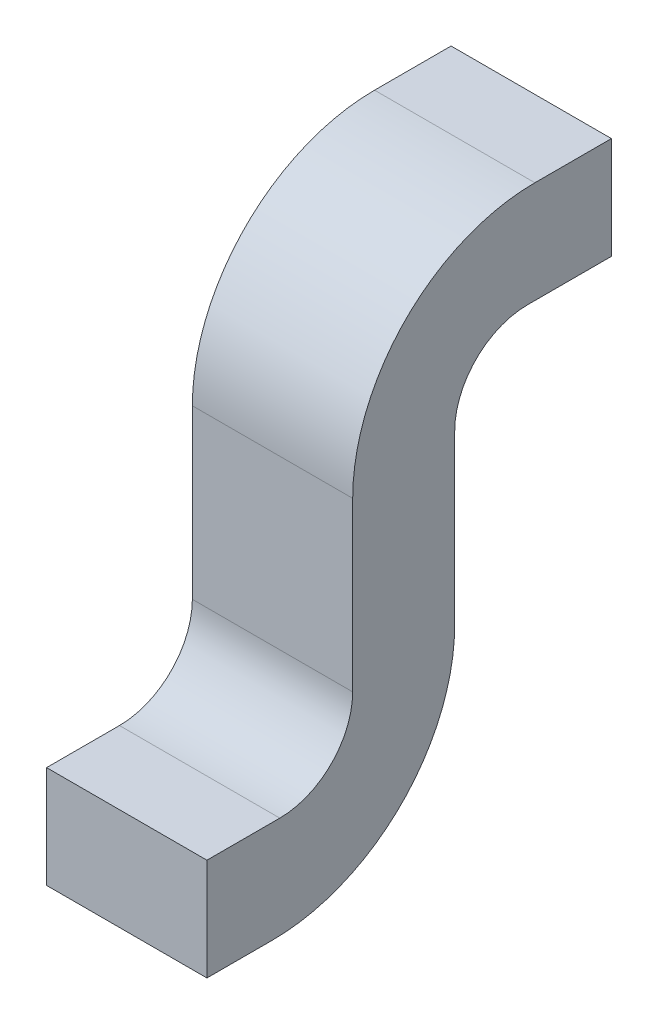
ISO-10303-21;
HEADER;
FILE_DESCRIPTION(('STEP AP214'),'2;1');
FILE_NAME('part.step','',(''),(''),'','','');
FILE_SCHEMA(('AUTOMOTIVE_DESIGN { 1 0 10303 214 1 1 1 1 }'));
ENDSEC;
DATA;
#1=APPLICATION_CONTEXT('core data for automotive mechanical design processes');
#2=APPLICATION_PROTOCOL_DEFINITION('international standard','automotive_design',2000,#1);
#3=PRODUCT_CONTEXT('',#1,'mechanical');
#4=PRODUCT('Part','Part','',(#3));
#5=PRODUCT_RELATED_PRODUCT_CATEGORY('part','',(#4));
#6=PRODUCT_DEFINITION_FORMATION('','',#4);
#7=PRODUCT_DEFINITION_CONTEXT('part definition',#1,'design');
#8=PRODUCT_DEFINITION('design','',#6,#7);
#9=PRODUCT_DEFINITION_SHAPE('','',#8);
#10=(LENGTH_UNIT() NAMED_UNIT(*) SI_UNIT(.MILLI.,.METRE.));
#11=(NAMED_UNIT(*) PLANE_ANGLE_UNIT() SI_UNIT($,.RADIAN.));
#12=(NAMED_UNIT(*) SI_UNIT($,.STERADIAN.) SOLID_ANGLE_UNIT());
#13=UNCERTAINTY_MEASURE_WITH_UNIT(LENGTH_MEASURE(1.E-05),#10,'distance_accuracy_value','');
#14=(GEOMETRIC_REPRESENTATION_CONTEXT(3) GLOBAL_UNCERTAINTY_ASSIGNED_CONTEXT((#13)) GLOBAL_UNIT_ASSIGNED_CONTEXT((#10,
#11,#12)) REPRESENTATION_CONTEXT('',''));
#15=CARTESIAN_POINT('',(0.,0.,0.));
#16=DIRECTION('',(0.,0.,1.));
#17=DIRECTION('',(1.,0.,0.));
#18=AXIS2_PLACEMENT_3D('',#15,#16,#17);
#19=CARTESIAN_POINT('',(0.76,0.165,0.545));
#20=DIRECTION('',(-1.,0.,0.));
#21=DIRECTION('',(0.,1.,0.));
#22=AXIS2_PLACEMENT_3D('',#19,#20,#21);
#23=PLANE('',#22);
#24=DIRECTION('',(0.,1.,0.));
#25=VECTOR('',#24,1.);
#26=CARTESIAN_POINT('',(0.76,0.165,1.1));
#27=LINE('',#26,#25);
#28=CARTESIAN_POINT('',(0.76,-0.485,1.1));
#29=VERTEX_POINT('',#28);
#30=CARTESIAN_POINT('',(0.76,-0.345,1.1));
#31=VERTEX_POINT('',#30);
#32=EDGE_CURVE('E198',#29,#31,#27,.T.);
#33=ORIENTED_EDGE('',*,*,#32,.F.);
#34=DIRECTION('',(0.,0.,1.));
#35=VECTOR('',#34,1.);
#36=CARTESIAN_POINT('',(0.76,-0.485,0.545));
#37=LINE('',#36,#35);
#38=CARTESIAN_POINT('',(0.76,-0.485,1.01));
#39=VERTEX_POINT('',#38);
#40=EDGE_CURVE('E199',#39,#29,#37,.T.);
#41=ORIENTED_EDGE('',*,*,#40,.F.);
#42=CARTESIAN_POINT('',(0.76,-0.235,1.01));
#43=DIRECTION('',(-1.,0.,0.));
#44=DIRECTION('',(0.,0.,1.));
#45=AXIS2_PLACEMENT_3D('',#42,#43,#44);
#46=CIRCLE('',#45,0.25);
#47=CARTESIAN_POINT('',(0.76,-0.235,0.76));
#48=VERTEX_POINT('',#47);
#49=EDGE_CURVE('E267',#48,#39,#46,.T.);
#50=ORIENTED_EDGE('',*,*,#49,.F.);
#51=DIRECTION('',(0.,-1.,0.));
#52=VECTOR('',#51,1.);
#53=CARTESIAN_POINT('',(0.76,0.165,0.76));
#54=LINE('',#53,#52);
#55=CARTESIAN_POINT('',(0.76,-0.004999999999999,0.76));
#56=VERTEX_POINT('',#55);
#57=EDGE_CURVE('E138',#56,#48,#54,.T.);
#58=ORIENTED_EDGE('',*,*,#57,.F.);
#59=CARTESIAN_POINT('',(0.76,-0.004999999999999,0.66));
#60=DIRECTION('',(1.,0.,0.));
#61=DIRECTION('',(0.,0.,1.));
#62=AXIS2_PLACEMENT_3D('',#59,#60,#61);
#63=CIRCLE('',#62,0.1);
#64=CARTESIAN_POINT('',(0.76,0.095,0.66));
#65=VERTEX_POINT('',#64);
#66=EDGE_CURVE('E143',#65,#56,#63,.T.);
#67=ORIENTED_EDGE('',*,*,#66,.F.);
#68=DIRECTION('',(0.,0.,1.));
#69=VECTOR('',#68,1.);
#70=CARTESIAN_POINT('',(0.76,0.095,0.545));
#71=LINE('',#70,#69);
#72=CARTESIAN_POINT('',(0.76,0.095,0.545));
#73=VERTEX_POINT('',#72);
#74=EDGE_CURVE('E146',#73,#65,#71,.T.);
#75=ORIENTED_EDGE('',*,*,#74,.F.);
#76=DIRECTION('',(0.,-1.,0.));
#77=VECTOR('',#76,1.);
#78=CARTESIAN_POINT('',(0.76,0.165,0.545));
#79=LINE('',#78,#77);
#80=CARTESIAN_POINT('',(0.76,0.235,0.545));
#81=VERTEX_POINT('',#80);
#82=EDGE_CURVE('E171',#81,#73,#79,.T.);
#83=ORIENTED_EDGE('',*,*,#82,.F.);
#84=DIRECTION('',(0.,0.,-1.));
#85=VECTOR('',#84,1.);
#86=CARTESIAN_POINT('',(0.76,0.235,0.545));
#87=LINE('',#86,#85);
#88=CARTESIAN_POINT('',(0.76,0.235,0.65));
#89=VERTEX_POINT('',#88);
#90=EDGE_CURVE('E200',#89,#81,#87,.T.);
#91=ORIENTED_EDGE('',*,*,#90,.F.);
#92=CARTESIAN_POINT('',(0.76,-0.015,0.65));
#93=DIRECTION('',(-1.,0.,0.));
#94=DIRECTION('',(0.,0.,1.));
#95=AXIS2_PLACEMENT_3D('',#92,#93,#94);
#96=CIRCLE('',#95,0.25);
#97=CARTESIAN_POINT('',(0.76,-0.015,0.9));
#98=VERTEX_POINT('',#97);
#99=EDGE_CURVE('E204',#98,#89,#96,.T.);
#100=ORIENTED_EDGE('',*,*,#99,.F.);
#101=DIRECTION('',(0.,1.,0.));
#102=VECTOR('',#101,1.);
#103=CARTESIAN_POINT('',(0.76,0.165,0.9));
#104=LINE('',#103,#102);
#105=CARTESIAN_POINT('',(0.76,-0.245,0.9));
#106=VERTEX_POINT('',#105);
#107=EDGE_CURVE('E208',#106,#98,#104,.T.);
#108=ORIENTED_EDGE('',*,*,#107,.F.);
#109=CARTESIAN_POINT('',(0.76,-0.245,1.));
#110=DIRECTION('',(1.,0.,0.));
#111=DIRECTION('',(0.,0.,1.));
#112=AXIS2_PLACEMENT_3D('',#109,#110,#111);
#113=CIRCLE('',#112,0.1);
#114=CARTESIAN_POINT('',(0.76,-0.345,1.));
#115=VERTEX_POINT('',#114);
#116=EDGE_CURVE('E209',#115,#106,#113,.T.);
#117=ORIENTED_EDGE('',*,*,#116,.F.);
#118=DIRECTION('',(0.,0.,-1.));
#119=VECTOR('',#118,1.);
#120=CARTESIAN_POINT('',(0.76,-0.345,0.545));
#121=LINE('',#120,#119);
#122=EDGE_CURVE('E11',#31,#115,#121,.T.);
#123=ORIENTED_EDGE('',*,*,#122,.F.);
#124=EDGE_LOOP('',(#33,#41,#50,#58,#67,#75,#83,#91,#100,#108,#117,#123));
#125=FACE_BOUND('',#124,.T.);
#126=ADVANCED_FACE('F16',(#125),#23,.F.);
#127=CARTESIAN_POINT('',(0.54,-0.345,1.05));
#128=DIRECTION('',(0.,1.,0.));
#129=DIRECTION('',(0.,0.,-1.));
#130=AXIS2_PLACEMENT_3D('',#127,#128,#129);
#131=PLANE('',#130);
#132=DIRECTION('',(0.,0.,1.));
#133=VECTOR('',#132,1.);
#134=CARTESIAN_POINT('',(0.54,-0.345,1.05));
#135=LINE('',#134,#133);
#136=CARTESIAN_POINT('',(0.54,-0.345,1.));
#137=VERTEX_POINT('',#136);
#138=CARTESIAN_POINT('',(0.54,-0.345,1.1));
#139=VERTEX_POINT('',#138);
#140=EDGE_CURVE('E188',#137,#139,#135,.T.);
#141=ORIENTED_EDGE('',*,*,#140,.T.);
#142=DIRECTION('',(1.,0.,0.));
#143=VECTOR('',#142,1.);
#144=CARTESIAN_POINT('',(0.54,-0.345,1.1));
#145=LINE('',#144,#143);
#146=EDGE_CURVE('E27',#139,#31,#145,.T.);
#147=ORIENTED_EDGE('',*,*,#146,.T.);
#148=ORIENTED_EDGE('',*,*,#122,.T.);
#149=DIRECTION('',(-1.,0.,0.));
#150=VECTOR('',#149,1.);
#151=CARTESIAN_POINT('',(0.54,-0.345,1.));
#152=LINE('',#151,#150);
#153=EDGE_CURVE('E125',#115,#137,#152,.T.);
#154=ORIENTED_EDGE('',*,*,#153,.T.);
#155=EDGE_LOOP('',(#141,#147,#148,#154));
#156=FACE_BOUND('',#155,.T.);
#157=ADVANCED_FACE('F390',(#156),#131,.T.);
#158=CARTESIAN_POINT('',(0.54,-0.415,1.1));
#159=DIRECTION('',(0.,0.,1.));
#160=DIRECTION('',(1.,0.,0.));
#161=AXIS2_PLACEMENT_3D('',#158,#159,#160);
#162=PLANE('',#161);
#163=DIRECTION('',(0.,-1.,0.));
#164=VECTOR('',#163,1.);
#165=CARTESIAN_POINT('',(0.54,-0.415,1.1));
#166=LINE('',#165,#164);
#167=CARTESIAN_POINT('',(0.54,-0.485,1.1));
#168=VERTEX_POINT('',#167);
#169=EDGE_CURVE('E250',#139,#168,#166,.T.);
#170=ORIENTED_EDGE('',*,*,#169,.T.);
#171=DIRECTION('',(1.,0.,0.));
#172=VECTOR('',#171,1.);
#173=CARTESIAN_POINT('',(0.54,-0.485,1.1));
#174=LINE('',#173,#172);
#175=EDGE_CURVE('E194',#168,#29,#174,.T.);
#176=ORIENTED_EDGE('',*,*,#175,.T.);
#177=ORIENTED_EDGE('',*,*,#32,.T.);
#178=ORIENTED_EDGE('',*,*,#146,.F.);
#179=EDGE_LOOP('',(#170,#176,#177,#178));
#180=FACE_BOUND('',#179,.T.);
#181=ADVANCED_FACE('F394',(#180),#162,.T.);
#182=CARTESIAN_POINT('',(0.54,-0.485,1.055));
#183=DIRECTION('',(0.,-1.,0.));
#184=DIRECTION('',(0.,0.,-1.));
#185=AXIS2_PLACEMENT_3D('',#182,#183,#184);
#186=PLANE('',#185);
#187=DIRECTION('',(0.,0.,-1.));
#188=VECTOR('',#187,1.);
#189=CARTESIAN_POINT('',(0.54,-0.485,1.055));
#190=LINE('',#189,#188);
#191=CARTESIAN_POINT('',(0.54,-0.485,1.01));
#192=VERTEX_POINT('',#191);
#193=EDGE_CURVE('E255',#168,#192,#190,.T.);
#194=ORIENTED_EDGE('',*,*,#193,.T.);
#195=DIRECTION('',(1.,0.,0.));
#196=VECTOR('',#195,1.);
#197=CARTESIAN_POINT('',(0.54,-0.485,1.01));
#198=LINE('',#197,#196);
#199=EDGE_CURVE('E193',#192,#39,#198,.T.);
#200=ORIENTED_EDGE('',*,*,#199,.T.);
#201=ORIENTED_EDGE('',*,*,#40,.T.);
#202=ORIENTED_EDGE('',*,*,#175,.F.);
#203=EDGE_LOOP('',(#194,#200,#201,#202));
#204=FACE_BOUND('',#203,.T.);
#205=ADVANCED_FACE('F385',(#204),#186,.T.);
#206=CARTESIAN_POINT('',(0.54,-0.235,1.01));
#207=DIRECTION('',(-1.,0.,0.));
#208=DIRECTION('',(0.,0.,1.));
#209=AXIS2_PLACEMENT_3D('',#206,#207,#208);
#210=CYLINDRICAL_SURFACE('',#209,0.25);
#211=ORIENTED_EDGE('',*,*,#199,.F.);
#212=CARTESIAN_POINT('',(0.54,-0.235,1.01));
#213=DIRECTION('',(1.,0.,0.));
#214=DIRECTION('',(0.,0.,1.));
#215=AXIS2_PLACEMENT_3D('',#212,#213,#214);
#216=CIRCLE('',#215,0.25);
#217=CARTESIAN_POINT('',(0.54,-0.235,0.76));
#218=VERTEX_POINT('',#217);
#219=EDGE_CURVE('E251',#192,#218,#216,.T.);
#220=ORIENTED_EDGE('',*,*,#219,.T.);
#221=DIRECTION('',(1.,0.,0.));
#222=VECTOR('',#221,1.);
#223=CARTESIAN_POINT('',(0.54,-0.235,0.76));
#224=LINE('',#223,#222);
#225=EDGE_CURVE('E189',#218,#48,#224,.T.);
#226=ORIENTED_EDGE('',*,*,#225,.T.);
#227=ORIENTED_EDGE('',*,*,#49,.T.);
#228=EDGE_LOOP('',(#211,#220,#226,#227));
#229=FACE_BOUND('',#228,.T.);
#230=ADVANCED_FACE('F18',(#229),#210,.T.);
#231=CARTESIAN_POINT('',(0.54,-0.12,0.76));
#232=DIRECTION('',(0.,0.,-1.));
#233=DIRECTION('',(-1.,0.,0.));
#234=AXIS2_PLACEMENT_3D('',#231,#232,#233);
#235=PLANE('',#234);
#236=DIRECTION('',(0.,1.,0.));
#237=VECTOR('',#236,1.);
#238=CARTESIAN_POINT('',(0.54,-0.12,0.76));
#239=LINE('',#238,#237);
#240=CARTESIAN_POINT('',(0.54,-0.004999999999999,0.76));
#241=VERTEX_POINT('',#240);
#242=EDGE_CURVE('E275',#218,#241,#239,.T.);
#243=ORIENTED_EDGE('',*,*,#242,.T.);
#244=DIRECTION('',(1.,0.,0.));
#245=VECTOR('',#244,1.);
#246=CARTESIAN_POINT('',(0.54,-0.004999999999998,0.76));
#247=LINE('',#246,#245);
#248=EDGE_CURVE('E150',#241,#56,#247,.T.);
#249=ORIENTED_EDGE('',*,*,#248,.T.);
#250=ORIENTED_EDGE('',*,*,#57,.T.);
#251=ORIENTED_EDGE('',*,*,#225,.F.);
#252=EDGE_LOOP('',(#243,#249,#250,#251));
#253=FACE_BOUND('',#252,.T.);
#254=ADVANCED_FACE('F273',(#253),#235,.T.);
#255=CARTESIAN_POINT('',(0.54,-0.004999999999999,0.66));
#256=DIRECTION('',(-1.,0.,0.));
#257=DIRECTION('',(0.,0.,1.));
#258=AXIS2_PLACEMENT_3D('',#255,#256,#257);
#259=CYLINDRICAL_SURFACE('',#258,0.1);
#260=DIRECTION('',(-1.,0.,0.));
#261=VECTOR('',#260,1.);
#262=CARTESIAN_POINT('',(0.54,0.095,0.66));
#263=LINE('',#262,#261);
#264=CARTESIAN_POINT('',(0.54,0.095,0.66));
#265=VERTEX_POINT('',#264);
#266=EDGE_CURVE('E151',#65,#265,#263,.T.);
#267=ORIENTED_EDGE('',*,*,#266,.F.);
#268=ORIENTED_EDGE('',*,*,#66,.T.);
#269=ORIENTED_EDGE('',*,*,#248,.F.);
#270=CARTESIAN_POINT('',(0.54,-0.004999999999999,0.66));
#271=DIRECTION('',(1.,0.,0.));
#272=DIRECTION('',(0.,0.,1.));
#273=AXIS2_PLACEMENT_3D('',#270,#271,#272);
#274=CIRCLE('',#273,0.1);
#275=EDGE_CURVE('E156',#265,#241,#274,.T.);
#276=ORIENTED_EDGE('',*,*,#275,.F.);
#277=EDGE_LOOP('',(#267,#268,#269,#276));
#278=FACE_BOUND('',#277,.T.);
#279=ADVANCED_FACE('F154',(#278),#259,.F.);
#280=CARTESIAN_POINT('',(0.54,0.095,0.6025));
#281=DIRECTION('',(0.,-1.,0.));
#282=DIRECTION('',(0.,0.,-1.));
#283=AXIS2_PLACEMENT_3D('',#280,#281,#282);
#284=PLANE('',#283);
#285=DIRECTION('',(0.,0.,-1.));
#286=VECTOR('',#285,1.);
#287=CARTESIAN_POINT('',(0.54,0.095,0.6025));
#288=LINE('',#287,#286);
#289=CARTESIAN_POINT('',(0.54,0.095,0.545));
#290=VERTEX_POINT('',#289);
#291=EDGE_CURVE('E281',#265,#290,#288,.T.);
#292=ORIENTED_EDGE('',*,*,#291,.T.);
#293=DIRECTION('',(1.,0.,0.));
#294=VECTOR('',#293,1.);
#295=CARTESIAN_POINT('',(0.54,0.095,0.545));
#296=LINE('',#295,#294);
#297=EDGE_CURVE('E163',#290,#73,#296,.T.);
#298=ORIENTED_EDGE('',*,*,#297,.T.);
#299=ORIENTED_EDGE('',*,*,#74,.T.);
#300=ORIENTED_EDGE('',*,*,#266,.T.);
#301=EDGE_LOOP('',(#292,#298,#299,#300));
#302=FACE_BOUND('',#301,.T.);
#303=ADVANCED_FACE('F162',(#302),#284,.T.);
#304=CARTESIAN_POINT('',(0.54,0.165,0.545));
#305=DIRECTION('',(0.,0.,-1.));
#306=DIRECTION('',(-1.,0.,0.));
#307=AXIS2_PLACEMENT_3D('',#304,#305,#306);
#308=PLANE('',#307);
#309=DIRECTION('',(0.,1.,0.));
#310=VECTOR('',#309,1.);
#311=CARTESIAN_POINT('',(0.54,0.165,0.545));
#312=LINE('',#311,#310);
#313=CARTESIAN_POINT('',(0.54,0.235,0.545));
#314=VERTEX_POINT('',#313);
#315=EDGE_CURVE('E221',#290,#314,#312,.T.);
#316=ORIENTED_EDGE('',*,*,#315,.T.);
#317=DIRECTION('',(1.,0.,0.));
#318=VECTOR('',#317,1.);
#319=CARTESIAN_POINT('',(0.54,0.235,0.545));
#320=LINE('',#319,#318);
#321=EDGE_CURVE('E20',#314,#81,#320,.T.);
#322=ORIENTED_EDGE('',*,*,#321,.T.);
#323=ORIENTED_EDGE('',*,*,#82,.T.);
#324=ORIENTED_EDGE('',*,*,#297,.F.);
#325=EDGE_LOOP('',(#316,#322,#323,#324));
#326=FACE_BOUND('',#325,.T.);
#327=ADVANCED_FACE('F219',(#326),#308,.T.);
#328=CARTESIAN_POINT('',(0.54,0.235,0.5975));
#329=DIRECTION('',(0.,1.,0.));
#330=DIRECTION('',(1.,0.,0.));
#331=AXIS2_PLACEMENT_3D('',#328,#329,#330);
#332=PLANE('',#331);
#333=DIRECTION('',(0.,0.,1.));
#334=VECTOR('',#333,1.);
#335=CARTESIAN_POINT('',(0.54,0.235,0.5975));
#336=LINE('',#335,#334);
#337=CARTESIAN_POINT('',(0.54,0.235,0.65));
#338=VERTEX_POINT('',#337);
#339=EDGE_CURVE('E183',#314,#338,#336,.T.);
#340=ORIENTED_EDGE('',*,*,#339,.T.);
#341=DIRECTION('',(1.,0.,0.));
#342=VECTOR('',#341,1.);
#343=CARTESIAN_POINT('',(0.54,0.235,0.65));
#344=LINE('',#343,#342);
#345=EDGE_CURVE('E227',#338,#89,#344,.T.);
#346=ORIENTED_EDGE('',*,*,#345,.T.);
#347=ORIENTED_EDGE('',*,*,#90,.T.);
#348=ORIENTED_EDGE('',*,*,#321,.F.);
#349=EDGE_LOOP('',(#340,#346,#347,#348));
#350=FACE_BOUND('',#349,.T.);
#351=ADVANCED_FACE('F226',(#350),#332,.T.);
#352=CARTESIAN_POINT('',(0.54,-0.015,0.65));
#353=DIRECTION('',(-1.,0.,0.));
#354=DIRECTION('',(0.,0.,1.));
#355=AXIS2_PLACEMENT_3D('',#352,#353,#354);
#356=CYLINDRICAL_SURFACE('',#355,0.25);
#357=ORIENTED_EDGE('',*,*,#345,.F.);
#358=CARTESIAN_POINT('',(0.54,-0.015,0.65));
#359=DIRECTION('',(1.,0.,0.));
#360=DIRECTION('',(0.,0.,1.));
#361=AXIS2_PLACEMENT_3D('',#358,#359,#360);
#362=CIRCLE('',#361,0.25);
#363=CARTESIAN_POINT('',(0.54,-0.015,0.9));
#364=VERTEX_POINT('',#363);
#365=EDGE_CURVE('E179',#338,#364,#362,.T.);
#366=ORIENTED_EDGE('',*,*,#365,.T.);
#367=DIRECTION('',(1.,0.,0.));
#368=VECTOR('',#367,1.);
#369=CARTESIAN_POINT('',(0.54,-0.015,0.9));
#370=LINE('',#369,#368);
#371=EDGE_CURVE('E232',#364,#98,#370,.T.);
#372=ORIENTED_EDGE('',*,*,#371,.T.);
#373=ORIENTED_EDGE('',*,*,#99,.T.);
#374=EDGE_LOOP('',(#357,#366,#372,#373));
#375=FACE_BOUND('',#374,.T.);
#376=ADVANCED_FACE('F231',(#375),#356,.T.);
#377=CARTESIAN_POINT('',(0.54,-0.13,0.9));
#378=DIRECTION('',(0.,0.,1.));
#379=DIRECTION('',(1.,0.,0.));
#380=AXIS2_PLACEMENT_3D('',#377,#378,#379);
#381=PLANE('',#380);
#382=DIRECTION('',(0.,-1.,0.));
#383=VECTOR('',#382,1.);
#384=CARTESIAN_POINT('',(0.54,-0.13,0.9));
#385=LINE('',#384,#383);
#386=CARTESIAN_POINT('',(0.54,-0.245,0.9));
#387=VERTEX_POINT('',#386);
#388=EDGE_CURVE('E174',#364,#387,#385,.T.);
#389=ORIENTED_EDGE('',*,*,#388,.T.);
#390=DIRECTION('',(1.,0.,0.));
#391=VECTOR('',#390,1.);
#392=CARTESIAN_POINT('',(0.54,-0.245,0.9));
#393=LINE('',#392,#391);
#394=EDGE_CURVE('E205',#387,#106,#393,.T.);
#395=ORIENTED_EDGE('',*,*,#394,.T.);
#396=ORIENTED_EDGE('',*,*,#107,.T.);
#397=ORIENTED_EDGE('',*,*,#371,.F.);
#398=EDGE_LOOP('',(#389,#395,#396,#397));
#399=FACE_BOUND('',#398,.T.);
#400=ADVANCED_FACE('F423',(#399),#381,.T.);
#401=CARTESIAN_POINT('',(0.54,-0.245,1.));
#402=DIRECTION('',(-1.,0.,0.));
#403=DIRECTION('',(0.,0.,1.));
#404=AXIS2_PLACEMENT_3D('',#401,#402,#403);
#405=CYLINDRICAL_SURFACE('',#404,0.1);
#406=ORIENTED_EDGE('',*,*,#153,.F.);
#407=ORIENTED_EDGE('',*,*,#116,.T.);
#408=ORIENTED_EDGE('',*,*,#394,.F.);
#409=CARTESIAN_POINT('',(0.54,-0.245,1.));
#410=DIRECTION('',(1.,0.,0.));
#411=DIRECTION('',(0.,0.,1.));
#412=AXIS2_PLACEMENT_3D('',#409,#410,#411);
#413=CIRCLE('',#412,0.1);
#414=EDGE_CURVE('E184',#137,#387,#413,.T.);
#415=ORIENTED_EDGE('',*,*,#414,.F.);
#416=EDGE_LOOP('',(#406,#407,#408,#415));
#417=FACE_BOUND('',#416,.T.);
#418=ADVANCED_FACE('F419',(#417),#405,.F.);
#419=CARTESIAN_POINT('',(0.54,-0.121132572617,0.825365755119));
#420=DIRECTION('',(-1.,0.,0.));
#421=DIRECTION('',(0.,1.,0.));
#422=AXIS2_PLACEMENT_3D('',#419,#420,#421);
#423=PLANE('',#422);
#424=ORIENTED_EDGE('',*,*,#219,.F.);
#425=ORIENTED_EDGE('',*,*,#193,.F.);
#426=ORIENTED_EDGE('',*,*,#169,.F.);
#427=ORIENTED_EDGE('',*,*,#140,.F.);
#428=ORIENTED_EDGE('',*,*,#414,.T.);
#429=ORIENTED_EDGE('',*,*,#388,.F.);
#430=ORIENTED_EDGE('',*,*,#365,.F.);
#431=ORIENTED_EDGE('',*,*,#339,.F.);
#432=ORIENTED_EDGE('',*,*,#315,.F.);
#433=ORIENTED_EDGE('',*,*,#291,.F.);
#434=ORIENTED_EDGE('',*,*,#275,.T.);
#435=ORIENTED_EDGE('',*,*,#242,.F.);
#436=EDGE_LOOP('',(#424,#425,#426,#427,#428,#429,#430,#431,#432,#433,#434,#435));
#437=FACE_BOUND('',#436,.T.);
#438=ADVANCED_FACE('F280',(#437),#423,.T.);
#439=CLOSED_SHELL('',(#126,#157,#181,#205,#230,#254,#279,#303,#327,#351,#376,#400,#418,#438));
#440=MANIFOLD_SOLID_BREP('B1',#439);
#441=ADVANCED_BREP_SHAPE_REPRESENTATION('',(#18,#440),#14);
#442=SHAPE_DEFINITION_REPRESENTATION(#9,#441);
ENDSEC;
END-ISO-10303-21;
